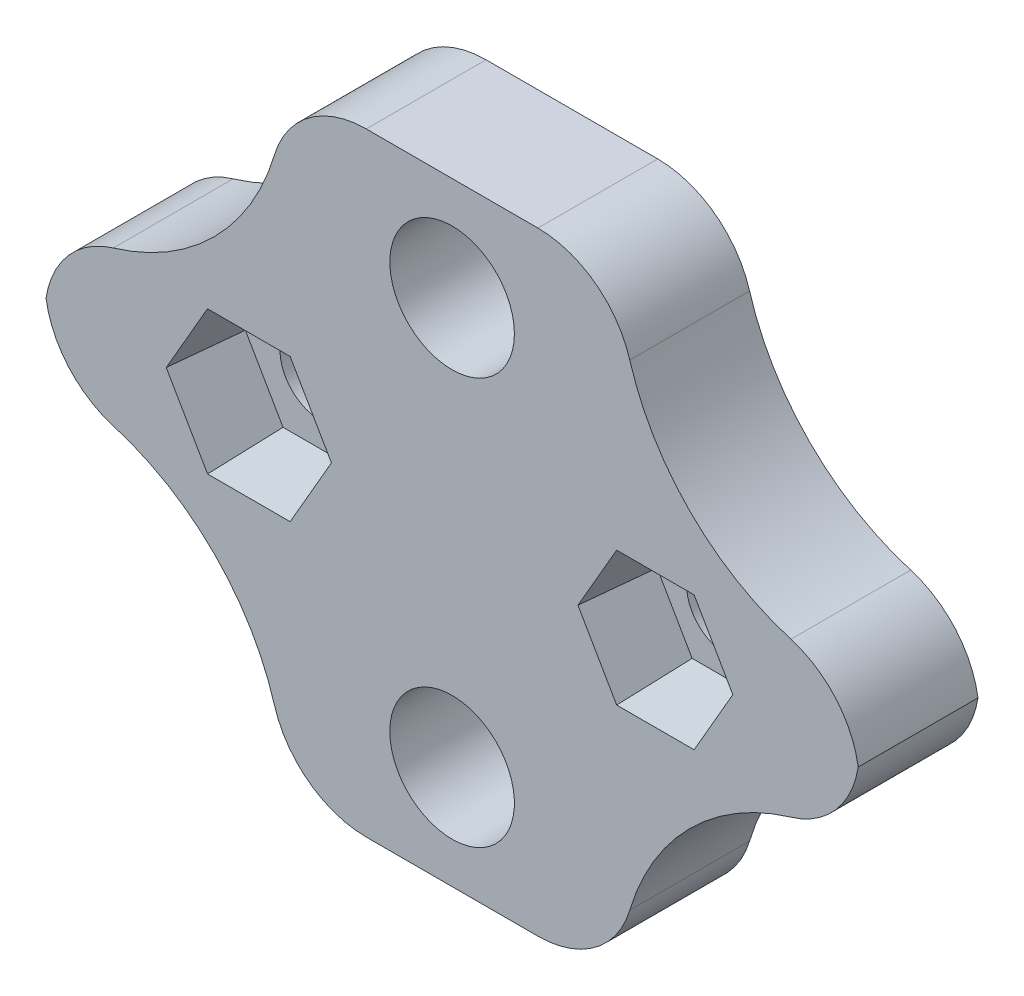
ISO-10303-21;
HEADER;
FILE_DESCRIPTION(('STEP AP214'),'2;1');
FILE_NAME('part.step','',(''),(''),'','','');
FILE_SCHEMA(('AUTOMOTIVE_DESIGN { 1 0 10303 214 1 1 1 1 }'));
ENDSEC;
DATA;
#1=APPLICATION_CONTEXT('core data for automotive mechanical design processes');
#2=APPLICATION_PROTOCOL_DEFINITION('international standard','automotive_design',2000,#1);
#3=PRODUCT_CONTEXT('',#1,'mechanical');
#4=PRODUCT('Part','Part','',(#3));
#5=PRODUCT_RELATED_PRODUCT_CATEGORY('part','',(#4));
#6=PRODUCT_DEFINITION_FORMATION('','',#4);
#7=PRODUCT_DEFINITION_CONTEXT('part definition',#1,'design');
#8=PRODUCT_DEFINITION('design','',#6,#7);
#9=PRODUCT_DEFINITION_SHAPE('','',#8);
#10=(LENGTH_UNIT() NAMED_UNIT(*) SI_UNIT(.MILLI.,.METRE.));
#11=(NAMED_UNIT(*) PLANE_ANGLE_UNIT() SI_UNIT($,.RADIAN.));
#12=(NAMED_UNIT(*) SI_UNIT($,.STERADIAN.) SOLID_ANGLE_UNIT());
#13=UNCERTAINTY_MEASURE_WITH_UNIT(LENGTH_MEASURE(1.E-05),#10,'distance_accuracy_value','');
#14=(GEOMETRIC_REPRESENTATION_CONTEXT(3) GLOBAL_UNCERTAINTY_ASSIGNED_CONTEXT((#13)) GLOBAL_UNIT_ASSIGNED_CONTEXT((#10,
#11,#12)) REPRESENTATION_CONTEXT('',''));
#15=CARTESIAN_POINT('',(0.,0.,0.));
#16=DIRECTION('',(0.,0.,1.));
#17=DIRECTION('',(1.,0.,0.));
#18=AXIS2_PLACEMENT_3D('',#15,#16,#17);
#19=CARTESIAN_POINT('',(5.243837776882,0.,5.));
#20=DIRECTION('',(0.,0.,-1.));
#21=DIRECTION('',(-1.,0.,0.));
#22=AXIS2_PLACEMENT_3D('',#19,#20,#21);
#23=CYLINDRICAL_SURFACE('',#22,1.7);
#24=CARTESIAN_POINT('',(5.243837776882,0.,0.));
#25=DIRECTION('',(0.,0.,1.));
#26=DIRECTION('',(-1.,0.,0.));
#27=AXIS2_PLACEMENT_3D('',#24,#25,#26);
#28=CIRCLE('',#27,1.7);
#29=CARTESIAN_POINT('',(3.543837776882,0.,0.));
#30=VERTEX_POINT('',#29);
#31=EDGE_CURVE('E412',#30,#30,#28,.T.);
#32=ORIENTED_EDGE('',*,*,#31,.F.);
#33=EDGE_LOOP('',(#32));
#34=FACE_BOUND('',#33,.T.);
#35=CARTESIAN_POINT('',(5.243837776882,0.,2.));
#36=DIRECTION('',(0.,0.,1.));
#37=DIRECTION('',(1.,0.,0.));
#38=AXIS2_PLACEMENT_3D('',#35,#36,#37);
#39=CIRCLE('',#38,1.7);
#40=CARTESIAN_POINT('',(6.943837776882,0.,2.));
#41=VERTEX_POINT('',#40);
#42=EDGE_CURVE('E314',#41,#41,#39,.T.);
#43=ORIENTED_EDGE('',*,*,#42,.T.);
#44=EDGE_LOOP('',(#43));
#45=FACE_BOUND('',#44,.T.);
#46=ADVANCED_FACE('F39',(#34,#45),#23,.F.);
#47=CARTESIAN_POINT('',(-11.7267249715951,0.,5.));
#48=DIRECTION('',(0.,0.,-1.));
#49=DIRECTION('',(-1.,0.,0.));
#50=AXIS2_PLACEMENT_3D('',#47,#48,#49);
#51=CYLINDRICAL_SURFACE('',#50,1.7);
#52=CARTESIAN_POINT('',(-11.7267249715951,0.,0.));
#53=DIRECTION('',(0.,0.,1.));
#54=DIRECTION('',(1.,0.,0.));
#55=AXIS2_PLACEMENT_3D('',#52,#53,#54);
#56=CIRCLE('',#55,1.7);
#57=CARTESIAN_POINT('',(-10.0267249715951,0.,0.));
#58=VERTEX_POINT('',#57);
#59=EDGE_CURVE('E429',#58,#58,#56,.T.);
#60=ORIENTED_EDGE('',*,*,#59,.F.);
#61=EDGE_LOOP('',(#60));
#62=FACE_BOUND('',#61,.T.);
#63=CARTESIAN_POINT('',(-11.7267249715951,0.,2.));
#64=DIRECTION('',(0.,0.,1.));
#65=DIRECTION('',(1.,0.,0.));
#66=AXIS2_PLACEMENT_3D('',#63,#64,#65);
#67=CIRCLE('',#66,1.7);
#68=CARTESIAN_POINT('',(-10.0267249715951,0.,2.));
#69=VERTEX_POINT('',#68);
#70=EDGE_CURVE('E372',#69,#69,#67,.T.);
#71=ORIENTED_EDGE('',*,*,#70,.T.);
#72=EDGE_LOOP('',(#71));
#73=FACE_BOUND('',#72,.T.);
#74=ADVANCED_FACE('F612',(#62,#73),#51,.F.);
#75=CARTESIAN_POINT('',(0.,0.,5.));
#76=DIRECTION('',(0.,0.,-1.));
#77=DIRECTION('',(-1.,0.,0.));
#78=AXIS2_PLACEMENT_3D('',#75,#76,#77);
#79=PLANE('',#78);
#80=DIRECTION('',(-0.5,0.866025403784439,0.));
#81=VECTOR('',#80,1.);
#82=CARTESIAN_POINT('',(8.47699928434391,0.,5.));
#83=LINE('',#82,#81);
#84=CARTESIAN_POINT('',(8.47699928434391,0.,5.));
#85=VERTEX_POINT('',#84);
#86=CARTESIAN_POINT('',(6.86041853061296,2.8,5.));
#87=VERTEX_POINT('',#86);
#88=EDGE_CURVE('E282',#85,#87,#83,.T.);
#89=ORIENTED_EDGE('',*,*,#88,.F.);
#90=DIRECTION('',(0.5,0.866025403784439,0.));
#91=VECTOR('',#90,1.);
#92=CARTESIAN_POINT('',(6.86041853061296,-2.8,5.));
#93=LINE('',#92,#91);
#94=CARTESIAN_POINT('',(6.86041853061296,-2.8,5.));
#95=VERTEX_POINT('',#94);
#96=EDGE_CURVE('E287',#95,#85,#93,.T.);
#97=ORIENTED_EDGE('',*,*,#96,.F.);
#98=DIRECTION('',(1.,0.,0.));
#99=VECTOR('',#98,1.);
#100=CARTESIAN_POINT('',(3.62725702315105,-2.8,5.));
#101=LINE('',#100,#99);
#102=CARTESIAN_POINT('',(3.62725702315105,-2.8,5.));
#103=VERTEX_POINT('',#102);
#104=EDGE_CURVE('E306',#103,#95,#101,.T.);
#105=ORIENTED_EDGE('',*,*,#104,.F.);
#106=DIRECTION('',(0.5,-0.866025403784438,0.));
#107=VECTOR('',#106,1.);
#108=CARTESIAN_POINT('',(2.0106762694201,0.,5.));
#109=LINE('',#108,#107);
#110=CARTESIAN_POINT('',(2.0106762694201,0.,5.));
#111=VERTEX_POINT('',#110);
#112=EDGE_CURVE('E299',#111,#103,#109,.T.);
#113=ORIENTED_EDGE('',*,*,#112,.F.);
#114=DIRECTION('',(-0.5,-0.866025403784439,0.));
#115=VECTOR('',#114,1.);
#116=CARTESIAN_POINT('',(3.62725702315105,2.8,5.));
#117=LINE('',#116,#115);
#118=CARTESIAN_POINT('',(3.62725702315105,2.8,5.));
#119=VERTEX_POINT('',#118);
#120=EDGE_CURVE('E293',#119,#111,#117,.T.);
#121=ORIENTED_EDGE('',*,*,#120,.F.);
#122=DIRECTION('',(-1.,0.,0.));
#123=VECTOR('',#122,1.);
#124=CARTESIAN_POINT('',(6.86041853061296,2.8,5.));
#125=LINE('',#124,#123);
#126=EDGE_CURVE('E269',#87,#119,#125,.T.);
#127=ORIENTED_EDGE('',*,*,#126,.F.);
#128=EDGE_LOOP('',(#89,#97,#105,#113,#121,#127));
#129=FACE_BOUND('',#128,.T.);
#130=DIRECTION('',(-0.500000000000001,0.866025403784438,0.));
#131=VECTOR('',#130,1.);
#132=CARTESIAN_POINT('',(-8.27845110569569,0.,5.));
#133=LINE('',#132,#131);
#134=CARTESIAN_POINT('',(-8.27845110569569,0.,5.));
#135=VERTEX_POINT('',#134);
#136=CARTESIAN_POINT('',(-10.0025880386454,2.98629276707487,5.));
#137=VERTEX_POINT('',#136);
#138=EDGE_CURVE('E348',#135,#137,#133,.T.);
#139=ORIENTED_EDGE('',*,*,#138,.F.);
#140=DIRECTION('',(0.499999999999995,0.866025403784441,0.));
#141=VECTOR('',#140,1.);
#142=CARTESIAN_POINT('',(-10.0025880386454,-2.98629276707484,5.));
#143=LINE('',#142,#141);
#144=CARTESIAN_POINT('',(-10.0025880386454,-2.98629276707484,5.));
#145=VERTEX_POINT('',#144);
#146=EDGE_CURVE('E345',#145,#135,#143,.T.);
#147=ORIENTED_EDGE('',*,*,#146,.F.);
#148=DIRECTION('',(1.,0.,0.));
#149=VECTOR('',#148,1.);
#150=CARTESIAN_POINT('',(-13.4508619045448,-2.98629276707488,5.));
#151=LINE('',#150,#149);
#152=CARTESIAN_POINT('',(-13.4508619045448,-2.98629276707488,5.));
#153=VERTEX_POINT('',#152);
#154=EDGE_CURVE('E364',#153,#145,#151,.T.);
#155=ORIENTED_EDGE('',*,*,#154,.F.);
#156=DIRECTION('',(0.500000000000007,-0.866025403784434,0.));
#157=VECTOR('',#156,1.);
#158=CARTESIAN_POINT('',(-15.1749988374945,0.,5.));
#159=LINE('',#158,#157);
#160=CARTESIAN_POINT('',(-15.1749988374945,0.,5.));
#161=VERTEX_POINT('',#160);
#162=EDGE_CURVE('E360',#161,#153,#159,.T.);
#163=ORIENTED_EDGE('',*,*,#162,.F.);
#164=DIRECTION('',(-0.499999999999995,-0.866025403784442,0.));
#165=VECTOR('',#164,1.);
#166=CARTESIAN_POINT('',(-13.4508619045448,2.98629276707486,5.));
#167=LINE('',#166,#165);
#168=CARTESIAN_POINT('',(-13.4508619045448,2.98629276707486,5.));
#169=VERTEX_POINT('',#168);
#170=EDGE_CURVE('E356',#169,#161,#167,.T.);
#171=ORIENTED_EDGE('',*,*,#170,.F.);
#172=DIRECTION('',(-1.,0.,0.));
#173=VECTOR('',#172,1.);
#174=CARTESIAN_POINT('',(-10.0025880386454,2.98629276707487,5.));
#175=LINE('',#174,#173);
#176=EDGE_CURVE('E352',#137,#169,#175,.T.);
#177=ORIENTED_EDGE('',*,*,#176,.F.);
#178=EDGE_LOOP('',(#139,#147,#155,#163,#171,#177));
#179=FACE_BOUND('',#178,.T.);
#180=CARTESIAN_POINT('',(-3.24144359735655,-8.48528137423859,5.));
#181=DIRECTION('',(0.,0.,1.));
#182=DIRECTION('',(-1.,0.,0.));
#183=AXIS2_PLACEMENT_3D('',#180,#181,#182);
#184=CIRCLE('',#183,2.6);
#185=CARTESIAN_POINT('',(-5.84144359735655,-8.48528137423859,5.));
#186=VERTEX_POINT('',#185);
#187=EDGE_CURVE('E417',#186,#186,#184,.T.);
#188=ORIENTED_EDGE('',*,*,#187,.F.);
#189=EDGE_LOOP('',(#188));
#190=FACE_BOUND('',#189,.T.);
#191=DIRECTION('',(1.,0.,0.));
#192=VECTOR('',#191,1.);
#193=CARTESIAN_POINT('',(-20.2414435973565,-12.8,5.));
#194=LINE('',#193,#192);
#195=CARTESIAN_POINT('',(-6.82503573235783,-12.8,5.));
#196=VERTEX_POINT('',#195);
#197=CARTESIAN_POINT('',(0.342148537644728,-12.8,5.));
#198=VERTEX_POINT('',#197);
#199=EDGE_CURVE('E441',#196,#198,#194,.T.);
#200=ORIENTED_EDGE('',*,*,#199,.T.);
#201=CARTESIAN_POINT('',(0.342148537644726,-8.8,5.));
#202=DIRECTION('',(0.,0.,-1.));
#203=DIRECTION('',(-1.,0.,0.));
#204=AXIS2_PLACEMENT_3D('',#201,#202,#203);
#205=CIRCLE('',#204,4.);
#206=CARTESIAN_POINT('',(4.17540792764437,-9.94285714285714,5.));
#207=VERTEX_POINT('',#206);
#208=EDGE_CURVE('E486',#198,#207,#205,.F.);
#209=ORIENTED_EDGE('',*,*,#208,.T.);
#210=CARTESIAN_POINT('',(13.7585564026435,-12.8,5.));
#211=DIRECTION('',(0.,0.,-1.));
#212=DIRECTION('',(-1.,0.,0.));
#213=AXIS2_PLACEMENT_3D('',#210,#211,#212);
#214=CIRCLE('',#213,10.);
#215=CARTESIAN_POINT('',(10.9014135455006,-3.2168515250009,5.));
#216=VERTEX_POINT('',#215);
#217=EDGE_CURVE('E944',#207,#216,#214,.T.);
#218=ORIENTED_EDGE('',*,*,#217,.T.);
#219=CARTESIAN_POINT('',(9.75855640264345,0.616407864998737,5.));
#220=DIRECTION('',(0.,0.,-1.));
#221=DIRECTION('',(-1.,0.,0.));
#222=AXIS2_PLACEMENT_3D('',#219,#220,#221);
#223=CIRCLE('',#222,4.);
#224=CARTESIAN_POINT('',(13.7107762021951,0.,5.));
#225=VERTEX_POINT('',#224);
#226=EDGE_CURVE('E483',#216,#225,#223,.F.);
#227=ORIENTED_EDGE('',*,*,#226,.T.);
#228=CARTESIAN_POINT('',(9.75855640264345,-0.616407864998737,5.));
#229=DIRECTION('',(0.,0.,-1.));
#230=DIRECTION('',(-1.,0.,0.));
#231=AXIS2_PLACEMENT_3D('',#228,#229,#230);
#232=CIRCLE('',#231,4.);
#233=CARTESIAN_POINT('',(10.9014135455006,3.2168515250009,5.));
#234=VERTEX_POINT('',#233);
#235=EDGE_CURVE('E481',#225,#234,#232,.F.);
#236=ORIENTED_EDGE('',*,*,#235,.T.);
#237=CARTESIAN_POINT('',(13.7585564026435,12.8,5.));
#238=DIRECTION('',(0.,0.,-1.));
#239=DIRECTION('',(-1.,0.,0.));
#240=AXIS2_PLACEMENT_3D('',#237,#238,#239);
#241=CIRCLE('',#240,10.);
#242=CARTESIAN_POINT('',(4.17540792764435,9.94285714285714,5.));
#243=VERTEX_POINT('',#242);
#244=EDGE_CURVE('E548',#234,#243,#241,.T.);
#245=ORIENTED_EDGE('',*,*,#244,.T.);
#246=CARTESIAN_POINT('',(0.342148537644712,8.8,5.));
#247=DIRECTION('',(0.,0.,-1.));
#248=DIRECTION('',(-1.,0.,0.));
#249=AXIS2_PLACEMENT_3D('',#246,#247,#248);
#250=CIRCLE('',#249,4.);
#251=CARTESIAN_POINT('',(0.342148537644714,12.8,5.));
#252=VERTEX_POINT('',#251);
#253=EDGE_CURVE('E478',#243,#252,#250,.F.);
#254=ORIENTED_EDGE('',*,*,#253,.T.);
#255=DIRECTION('',(-1.,0.,0.));
#256=VECTOR('',#255,1.);
#257=CARTESIAN_POINT('',(-20.2414435973566,12.8,5.));
#258=LINE('',#257,#256);
#259=CARTESIAN_POINT('',(-6.82503573235781,12.8,5.));
#260=VERTEX_POINT('',#259);
#261=EDGE_CURVE('E437',#252,#260,#258,.T.);
#262=ORIENTED_EDGE('',*,*,#261,.T.);
#263=CARTESIAN_POINT('',(-6.82503573235781,8.8,5.));
#264=DIRECTION('',(0.,0.,-1.));
#265=DIRECTION('',(-1.,0.,0.));
#266=AXIS2_PLACEMENT_3D('',#263,#264,#265);
#267=CIRCLE('',#266,4.);
#268=CARTESIAN_POINT('',(-10.6582951223575,9.94285714285714,5.));
#269=VERTEX_POINT('',#268);
#270=EDGE_CURVE('E466',#260,#269,#267,.F.);
#271=ORIENTED_EDGE('',*,*,#270,.T.);
#272=CARTESIAN_POINT('',(-20.2414435973566,12.8,5.));
#273=DIRECTION('',(0.,0.,-1.));
#274=DIRECTION('',(-1.,0.,0.));
#275=AXIS2_PLACEMENT_3D('',#272,#273,#274);
#276=CIRCLE('',#275,10.);
#277=CARTESIAN_POINT('',(-17.3843007402137,3.2168515250009,5.));
#278=VERTEX_POINT('',#277);
#279=EDGE_CURVE('E573',#269,#278,#276,.T.);
#280=ORIENTED_EDGE('',*,*,#279,.T.);
#281=CARTESIAN_POINT('',(-16.2414435973565,-0.616407864998735,5.));
#282=DIRECTION('',(0.,0.,-1.));
#283=DIRECTION('',(-1.,0.,0.));
#284=AXIS2_PLACEMENT_3D('',#281,#282,#283);
#285=CIRCLE('',#284,4.);
#286=CARTESIAN_POINT('',(-20.1936633969081,0.,5.));
#287=VERTEX_POINT('',#286);
#288=EDGE_CURVE('E469',#278,#287,#285,.F.);
#289=ORIENTED_EDGE('',*,*,#288,.T.);
#290=CARTESIAN_POINT('',(-16.2414435973565,0.616407864998735,5.));
#291=DIRECTION('',(0.,0.,-1.));
#292=DIRECTION('',(-1.,0.,0.));
#293=AXIS2_PLACEMENT_3D('',#290,#291,#292);
#294=CIRCLE('',#293,4.);
#295=CARTESIAN_POINT('',(-17.3843007402137,-3.2168515250009,5.));
#296=VERTEX_POINT('',#295);
#297=EDGE_CURVE('E472',#287,#296,#294,.F.);
#298=ORIENTED_EDGE('',*,*,#297,.T.);
#299=CARTESIAN_POINT('',(-20.2414435973566,-12.8,5.));
#300=DIRECTION('',(0.,0.,-1.));
#301=DIRECTION('',(-1.,0.,0.));
#302=AXIS2_PLACEMENT_3D('',#299,#300,#301);
#303=CIRCLE('',#302,10.);
#304=CARTESIAN_POINT('',(-10.6582951223575,-9.94285714285714,5.));
#305=VERTEX_POINT('',#304);
#306=EDGE_CURVE('E574',#296,#305,#303,.T.);
#307=ORIENTED_EDGE('',*,*,#306,.T.);
#308=CARTESIAN_POINT('',(-6.82503573235783,-8.8,5.));
#309=DIRECTION('',(0.,0.,-1.));
#310=DIRECTION('',(-1.,0.,0.));
#311=AXIS2_PLACEMENT_3D('',#308,#309,#310);
#312=CIRCLE('',#311,4.);
#313=EDGE_CURVE('E475',#305,#196,#312,.F.);
#314=ORIENTED_EDGE('',*,*,#313,.T.);
#315=EDGE_LOOP('',(#200,#209,#218,#227,#236,#245,#254,#262,#271,#280,#289,#298,#307,#314));
#316=FACE_BOUND('',#315,.T.);
#317=CARTESIAN_POINT('',(-3.24144359735655,8.48528137423859,5.));
#318=DIRECTION('',(0.,0.,1.));
#319=DIRECTION('',(1.,0.,0.));
#320=AXIS2_PLACEMENT_3D('',#317,#318,#319);
#321=CIRCLE('',#320,2.6);
#322=CARTESIAN_POINT('',(-0.64144359735655,8.48528137423859,5.));
#323=VERTEX_POINT('',#322);
#324=EDGE_CURVE('E425',#323,#323,#321,.T.);
#325=ORIENTED_EDGE('',*,*,#324,.F.);
#326=EDGE_LOOP('',(#325));
#327=FACE_BOUND('',#326,.T.);
#328=ADVANCED_FACE('F289',(#129,#179,#190,#316,#327),#79,.F.);
#329=CARTESIAN_POINT('',(0.,0.,0.));
#330=DIRECTION('',(0.,0.,-1.));
#331=DIRECTION('',(-1.,0.,0.));
#332=AXIS2_PLACEMENT_3D('',#329,#330,#331);
#333=PLANE('',#332);
#334=CARTESIAN_POINT('',(13.7585564026435,-12.8,0.));
#335=DIRECTION('',(0.,0.,-1.));
#336=DIRECTION('',(-1.,0.,0.));
#337=AXIS2_PLACEMENT_3D('',#334,#335,#336);
#338=CIRCLE('',#337,10.);
#339=CARTESIAN_POINT('',(4.17540792764437,-9.94285714285714,0.));
#340=VERTEX_POINT('',#339);
#341=CARTESIAN_POINT('',(10.9014135455006,-3.2168515250009,0.));
#342=VERTEX_POINT('',#341);
#343=EDGE_CURVE('E946',#340,#342,#338,.T.);
#344=ORIENTED_EDGE('',*,*,#343,.F.);
#345=CARTESIAN_POINT('',(0.342148537644726,-8.8,0.));
#346=DIRECTION('',(0.,0.,-1.));
#347=DIRECTION('',(-1.,0.,0.));
#348=AXIS2_PLACEMENT_3D('',#345,#346,#347);
#349=CIRCLE('',#348,4.);
#350=CARTESIAN_POINT('',(0.342148537644728,-12.8,0.));
#351=VERTEX_POINT('',#350);
#352=EDGE_CURVE('E515',#340,#351,#349,.T.);
#353=ORIENTED_EDGE('',*,*,#352,.T.);
#354=DIRECTION('',(1.,0.,0.));
#355=VECTOR('',#354,1.);
#356=CARTESIAN_POINT('',(-20.2414435973565,-12.8,0.));
#357=LINE('',#356,#355);
#358=CARTESIAN_POINT('',(-6.82503573235783,-12.8,0.));
#359=VERTEX_POINT('',#358);
#360=EDGE_CURVE('E442',#359,#351,#357,.T.);
#361=ORIENTED_EDGE('',*,*,#360,.F.);
#362=CARTESIAN_POINT('',(-6.82503573235783,-8.8,0.));
#363=DIRECTION('',(0.,0.,-1.));
#364=DIRECTION('',(-1.,0.,0.));
#365=AXIS2_PLACEMENT_3D('',#362,#363,#364);
#366=CIRCLE('',#365,4.);
#367=CARTESIAN_POINT('',(-10.6582951223575,-9.94285714285714,0.));
#368=VERTEX_POINT('',#367);
#369=EDGE_CURVE('E504',#359,#368,#366,.T.);
#370=ORIENTED_EDGE('',*,*,#369,.T.);
#371=CARTESIAN_POINT('',(-20.2414435973566,-12.8,0.));
#372=DIRECTION('',(0.,0.,-1.));
#373=DIRECTION('',(1.,0.,0.));
#374=AXIS2_PLACEMENT_3D('',#371,#372,#373);
#375=CIRCLE('',#374,10.);
#376=CARTESIAN_POINT('',(-17.3843007402137,-3.2168515250009,0.));
#377=VERTEX_POINT('',#376);
#378=EDGE_CURVE('E580',#377,#368,#375,.T.);
#379=ORIENTED_EDGE('',*,*,#378,.F.);
#380=CARTESIAN_POINT('',(-16.2414435973565,0.616407864998735,0.));
#381=DIRECTION('',(0.,0.,-1.));
#382=DIRECTION('',(-1.,0.,0.));
#383=AXIS2_PLACEMENT_3D('',#380,#381,#382);
#384=CIRCLE('',#383,4.);
#385=CARTESIAN_POINT('',(-20.1936633969081,0.,0.));
#386=VERTEX_POINT('',#385);
#387=EDGE_CURVE('E70',#377,#386,#384,.T.);
#388=ORIENTED_EDGE('',*,*,#387,.T.);
#389=CARTESIAN_POINT('',(-16.2414435973565,-0.616407864998735,0.));
#390=DIRECTION('',(0.,0.,-1.));
#391=DIRECTION('',(-1.,0.,0.));
#392=AXIS2_PLACEMENT_3D('',#389,#390,#391);
#393=CIRCLE('',#392,4.);
#394=CARTESIAN_POINT('',(-17.3843007402137,3.2168515250009,0.));
#395=VERTEX_POINT('',#394);
#396=EDGE_CURVE('E499',#386,#395,#393,.T.);
#397=ORIENTED_EDGE('',*,*,#396,.T.);
#398=CARTESIAN_POINT('',(-20.2414435973566,12.8,0.));
#399=DIRECTION('',(0.,0.,-1.));
#400=DIRECTION('',(-1.,0.,0.));
#401=AXIS2_PLACEMENT_3D('',#398,#399,#400);
#402=CIRCLE('',#401,10.);
#403=CARTESIAN_POINT('',(-10.6582951223575,9.94285714285714,0.));
#404=VERTEX_POINT('',#403);
#405=EDGE_CURVE('E566',#404,#395,#402,.T.);
#406=ORIENTED_EDGE('',*,*,#405,.F.);
#407=CARTESIAN_POINT('',(-6.82503573235781,8.8,0.));
#408=DIRECTION('',(0.,0.,-1.));
#409=DIRECTION('',(-1.,0.,0.));
#410=AXIS2_PLACEMENT_3D('',#407,#408,#409);
#411=CIRCLE('',#410,4.);
#412=CARTESIAN_POINT('',(-6.82503573235781,12.8,0.));
#413=VERTEX_POINT('',#412);
#414=EDGE_CURVE('E496',#404,#413,#411,.T.);
#415=ORIENTED_EDGE('',*,*,#414,.T.);
#416=DIRECTION('',(-1.,0.,0.));
#417=VECTOR('',#416,1.);
#418=CARTESIAN_POINT('',(-20.2414435973566,12.8,0.));
#419=LINE('',#418,#417);
#420=CARTESIAN_POINT('',(0.342148537644714,12.8,0.));
#421=VERTEX_POINT('',#420);
#422=EDGE_CURVE('E436',#421,#413,#419,.T.);
#423=ORIENTED_EDGE('',*,*,#422,.F.);
#424=CARTESIAN_POINT('',(0.342148537644712,8.8,0.));
#425=DIRECTION('',(0.,0.,-1.));
#426=DIRECTION('',(-1.,0.,0.));
#427=AXIS2_PLACEMENT_3D('',#424,#425,#426);
#428=CIRCLE('',#427,4.);
#429=CARTESIAN_POINT('',(4.17540792764435,9.94285714285714,0.));
#430=VERTEX_POINT('',#429);
#431=EDGE_CURVE('E507',#421,#430,#428,.T.);
#432=ORIENTED_EDGE('',*,*,#431,.T.);
#433=CARTESIAN_POINT('',(13.7585564026435,12.8,0.));
#434=DIRECTION('',(0.,0.,-1.));
#435=DIRECTION('',(1.,0.,0.));
#436=AXIS2_PLACEMENT_3D('',#433,#434,#435);
#437=CIRCLE('',#436,10.);
#438=CARTESIAN_POINT('',(10.9014135455006,3.2168515250009,0.));
#439=VERTEX_POINT('',#438);
#440=EDGE_CURVE('E543',#439,#430,#437,.T.);
#441=ORIENTED_EDGE('',*,*,#440,.F.);
#442=CARTESIAN_POINT('',(9.75855640264345,-0.616407864998737,0.));
#443=DIRECTION('',(0.,0.,-1.));
#444=DIRECTION('',(-1.,0.,0.));
#445=AXIS2_PLACEMENT_3D('',#442,#443,#444);
#446=CIRCLE('',#445,4.);
#447=CARTESIAN_POINT('',(13.7107762021951,0.,0.));
#448=VERTEX_POINT('',#447);
#449=EDGE_CURVE('E60',#439,#448,#446,.T.);
#450=ORIENTED_EDGE('',*,*,#449,.T.);
#451=CARTESIAN_POINT('',(9.75855640264345,0.616407864998737,0.));
#452=DIRECTION('',(0.,0.,-1.));
#453=DIRECTION('',(-1.,0.,0.));
#454=AXIS2_PLACEMENT_3D('',#451,#452,#453);
#455=CIRCLE('',#454,4.);
#456=EDGE_CURVE('E512',#448,#342,#455,.T.);
#457=ORIENTED_EDGE('',*,*,#456,.T.);
#458=EDGE_LOOP('',(#344,#353,#361,#370,#379,#388,#397,#406,#415,#423,#432,#441,#450,#457));
#459=FACE_BOUND('',#458,.T.);
#460=CARTESIAN_POINT('',(-3.24144359735655,-8.48528137423859,0.));
#461=DIRECTION('',(0.,0.,1.));
#462=DIRECTION('',(-1.,0.,0.));
#463=AXIS2_PLACEMENT_3D('',#460,#461,#462);
#464=CIRCLE('',#463,2.6);
#465=CARTESIAN_POINT('',(-5.84144359735655,-8.48528137423859,0.));
#466=VERTEX_POINT('',#465);
#467=EDGE_CURVE('E416',#466,#466,#464,.T.);
#468=ORIENTED_EDGE('',*,*,#467,.T.);
#469=EDGE_LOOP('',(#468));
#470=FACE_BOUND('',#469,.T.);
#471=ORIENTED_EDGE('',*,*,#59,.T.);
#472=EDGE_LOOP('',(#471));
#473=FACE_BOUND('',#472,.T.);
#474=CARTESIAN_POINT('',(-3.24144359735655,8.48528137423859,0.));
#475=DIRECTION('',(0.,0.,1.));
#476=DIRECTION('',(1.,0.,0.));
#477=AXIS2_PLACEMENT_3D('',#474,#475,#476);
#478=CIRCLE('',#477,2.6);
#479=CARTESIAN_POINT('',(-0.64144359735655,8.48528137423859,0.));
#480=VERTEX_POINT('',#479);
#481=EDGE_CURVE('E421',#480,#480,#478,.T.);
#482=ORIENTED_EDGE('',*,*,#481,.T.);
#483=EDGE_LOOP('',(#482));
#484=FACE_BOUND('',#483,.T.);
#485=ORIENTED_EDGE('',*,*,#31,.T.);
#486=EDGE_LOOP('',(#485));
#487=FACE_BOUND('',#486,.T.);
#488=ADVANCED_FACE('F564',(#459,#470,#473,#484,#487),#333,.T.);
#489=CARTESIAN_POINT('',(-20.2414435973566,12.8,5.));
#490=DIRECTION('',(0.,-1.,0.));
#491=DIRECTION('',(0.,0.,-1.));
#492=AXIS2_PLACEMENT_3D('',#489,#490,#491);
#493=PLANE('',#492);
#494=ORIENTED_EDGE('',*,*,#261,.F.);
#495=DIRECTION('',(0.,0.,-1.));
#496=VECTOR('',#495,1.);
#497=CARTESIAN_POINT('',(0.342148537644714,12.8,5.));
#498=LINE('',#497,#496);
#499=EDGE_CURVE('E527',#252,#421,#498,.T.);
#500=ORIENTED_EDGE('',*,*,#499,.T.);
#501=ORIENTED_EDGE('',*,*,#422,.T.);
#502=DIRECTION('',(0.,0.,-1.));
#503=VECTOR('',#502,1.);
#504=CARTESIAN_POINT('',(-6.82503573235781,12.8,5.));
#505=LINE('',#504,#503);
#506=EDGE_CURVE('E524',#413,#260,#505,.F.);
#507=ORIENTED_EDGE('',*,*,#506,.T.);
#508=EDGE_LOOP('',(#494,#500,#501,#507));
#509=FACE_BOUND('',#508,.T.);
#510=ADVANCED_FACE('F640',(#509),#493,.F.);
#511=CARTESIAN_POINT('',(-20.2414435973565,-12.8,5.));
#512=DIRECTION('',(0.,1.,0.));
#513=DIRECTION('',(0.,0.,1.));
#514=AXIS2_PLACEMENT_3D('',#511,#512,#513);
#515=PLANE('',#514);
#516=ORIENTED_EDGE('',*,*,#360,.T.);
#517=DIRECTION('',(0.,0.,-1.));
#518=VECTOR('',#517,1.);
#519=CARTESIAN_POINT('',(0.342148537644728,-12.8,5.));
#520=LINE('',#519,#518);
#521=EDGE_CURVE('E462',#351,#198,#520,.F.);
#522=ORIENTED_EDGE('',*,*,#521,.T.);
#523=ORIENTED_EDGE('',*,*,#199,.F.);
#524=DIRECTION('',(0.,0.,-1.));
#525=VECTOR('',#524,1.);
#526=CARTESIAN_POINT('',(-6.82503573235783,-12.8,5.));
#527=LINE('',#526,#525);
#528=EDGE_CURVE('E446',#196,#359,#527,.T.);
#529=ORIENTED_EDGE('',*,*,#528,.T.);
#530=EDGE_LOOP('',(#516,#522,#523,#529));
#531=FACE_BOUND('',#530,.T.);
#532=ADVANCED_FACE('F633',(#531),#515,.F.);
#533=CARTESIAN_POINT('',(-3.24144359735655,8.48528137423859,5.));
#534=DIRECTION('',(0.,0.,-1.));
#535=DIRECTION('',(-1.,0.,0.));
#536=AXIS2_PLACEMENT_3D('',#533,#534,#535);
#537=CYLINDRICAL_SURFACE('',#536,2.6);
#538=ORIENTED_EDGE('',*,*,#324,.T.);
#539=EDGE_LOOP('',(#538));
#540=FACE_BOUND('',#539,.T.);
#541=ORIENTED_EDGE('',*,*,#481,.F.);
#542=EDGE_LOOP('',(#541));
#543=FACE_BOUND('',#542,.T.);
#544=ADVANCED_FACE('F630',(#540,#543),#537,.F.);
#545=CARTESIAN_POINT('',(-3.24144359735655,-8.48528137423859,5.));
#546=DIRECTION('',(0.,0.,-1.));
#547=DIRECTION('',(-1.,0.,0.));
#548=AXIS2_PLACEMENT_3D('',#545,#546,#547);
#549=CYLINDRICAL_SURFACE('',#548,2.6);
#550=ORIENTED_EDGE('',*,*,#187,.T.);
#551=EDGE_LOOP('',(#550));
#552=FACE_BOUND('',#551,.T.);
#553=ORIENTED_EDGE('',*,*,#467,.F.);
#554=EDGE_LOOP('',(#553));
#555=FACE_BOUND('',#554,.T.);
#556=ADVANCED_FACE('F626',(#552,#555),#549,.F.);
#557=CARTESIAN_POINT('',(-10.0025880386454,-2.98629276707484,5.));
#558=DIRECTION('',(0.862729915662824,-0.498097349045868,-0.0871557427476584));
#559=DIRECTION('',(0.499999999999995,0.866025403784441,0.));
#560=AXIS2_PLACEMENT_3D('',#557,#558,#559);
#561=PLANE('',#560);
#562=ORIENTED_EDGE('',*,*,#146,.T.);
#563=DIRECTION('',(0.100511613750392,0.,0.994935885120891));
#564=VECTOR('',#563,1.);
#565=CARTESIAN_POINT('',(-8.29586934474816,0.,4.8275818043082));
#566=LINE('',#565,#564);
#567=CARTESIAN_POINT('',(-8.58152072632209,0.,2.));
#568=VERTEX_POINT('',#567);
#569=EDGE_CURVE('E374',#568,#135,#566,.T.);
#570=ORIENTED_EDGE('',*,*,#569,.F.);
#571=DIRECTION('',(0.499999999999995,0.866025403784441,0.));
#572=VECTOR('',#571,1.);
#573=CARTESIAN_POINT('',(-6.43614054474161,3.71590747604878,2.));
#574=LINE('',#573,#572);
#575=CARTESIAN_POINT('',(-10.1541228489586,-2.72382677649707,2.));
#576=VERTEX_POINT('',#575);
#577=EDGE_CURVE('E368',#576,#568,#574,.T.);
#578=ORIENTED_EDGE('',*,*,#577,.F.);
#579=DIRECTION('',(0.0502558068751969,-0.0870456108832087,0.994935885120891));
#580=VECTOR('',#579,1.);
#581=CARTESIAN_POINT('',(-10.0112971581716,-2.97120812956622,4.8275818043082));
#582=LINE('',#581,#580);
#583=EDGE_CURVE('E369',#576,#145,#582,.T.);
#584=ORIENTED_EDGE('',*,*,#583,.T.);
#585=EDGE_LOOP('',(#562,#570,#578,#584));
#586=FACE_BOUND('',#585,.T.);
#587=ADVANCED_FACE('F629',(#586),#561,.F.);
#588=CARTESIAN_POINT('',(-13.4508619045448,-2.98629276707488,5.));
#589=DIRECTION('',(0.,-0.996194698091745,-0.0871557427476584));
#590=DIRECTION('',(0.,0.0871557427476584,-0.996194698091746));
#591=AXIS2_PLACEMENT_3D('',#588,#589,#590);
#592=PLANE('',#591);
#593=ORIENTED_EDGE('',*,*,#154,.T.);
#594=ORIENTED_EDGE('',*,*,#583,.F.);
#595=DIRECTION('',(1.,0.,0.));
#596=VECTOR('',#595,1.);
#597=CARTESIAN_POINT('',(0.,-2.72382677649697,2.));
#598=LINE('',#597,#596);
#599=CARTESIAN_POINT('',(-13.2993270942316,-2.7238267764971,2.));
#600=VERTEX_POINT('',#599);
#601=EDGE_CURVE('E379',#600,#576,#598,.T.);
#602=ORIENTED_EDGE('',*,*,#601,.F.);
#603=DIRECTION('',(-0.0502558068751955,-0.0870456108832098,0.994935885120892));
#604=VECTOR('',#603,1.);
#605=CARTESIAN_POINT('',(-13.4421527850185,-2.97120812956625,4.82758180430819));
#606=LINE('',#605,#604);
#607=EDGE_CURVE('E373',#600,#153,#606,.T.);
#608=ORIENTED_EDGE('',*,*,#607,.T.);
#609=EDGE_LOOP('',(#593,#594,#602,#608));
#610=FACE_BOUND('',#609,.T.);
#611=ADVANCED_FACE('F624',(#610),#592,.F.);
#612=CARTESIAN_POINT('',(-15.1749988374945,0.,5.));
#613=DIRECTION('',(-0.862729915662817,-0.49809734904588,-0.0871557427476584));
#614=DIRECTION('',(0.500000000000007,-0.866025403784434,0.));
#615=AXIS2_PLACEMENT_3D('',#612,#613,#614);
#616=PLANE('',#615);
#617=ORIENTED_EDGE('',*,*,#162,.T.);
#618=ORIENTED_EDGE('',*,*,#607,.F.);
#619=DIRECTION('',(0.500000000000007,-0.866025403784434,0.));
#620=VECTOR('',#619,1.);
#621=CARTESIAN_POINT('',(-11.153946912651,-6.43973425254597,2.));
#622=LINE('',#621,#620);
#623=CARTESIAN_POINT('',(-14.8719292168681,0.,2.));
#624=VERTEX_POINT('',#623);
#625=EDGE_CURVE('E397',#624,#600,#622,.T.);
#626=ORIENTED_EDGE('',*,*,#625,.F.);
#627=DIRECTION('',(-0.100511613750393,0.,0.994935885120892));
#628=VECTOR('',#627,1.);
#629=CARTESIAN_POINT('',(-15.157580598442,0.,4.82758180430819));
#630=LINE('',#629,#628);
#631=EDGE_CURVE('E385',#624,#161,#630,.T.);
#632=ORIENTED_EDGE('',*,*,#631,.T.);
#633=EDGE_LOOP('',(#617,#618,#626,#632));
#634=FACE_BOUND('',#633,.T.);
#635=ADVANCED_FACE('F826',(#634),#616,.F.);
#636=CARTESIAN_POINT('',(-13.4508619045448,2.98629276707486,5.));
#637=DIRECTION('',(-0.862729915662824,0.498097349045868,-0.0871557427476584));
#638=DIRECTION('',(-0.499999999999995,-0.866025403784442,0.));
#639=AXIS2_PLACEMENT_3D('',#636,#637,#638);
#640=PLANE('',#639);
#641=ORIENTED_EDGE('',*,*,#170,.T.);
#642=ORIENTED_EDGE('',*,*,#631,.F.);
#643=DIRECTION('',(-0.499999999999995,-0.866025403784442,0.));
#644=VECTOR('',#643,1.);
#645=CARTESIAN_POINT('',(-11.1539469126512,6.43973425254585,2.));
#646=LINE('',#645,#644);
#647=CARTESIAN_POINT('',(-13.2993270942316,2.72382677649708,2.));
#648=VERTEX_POINT('',#647);
#649=EDGE_CURVE('E401',#648,#624,#646,.T.);
#650=ORIENTED_EDGE('',*,*,#649,.F.);
#651=DIRECTION('',(-0.0502558068751967,0.0870456108832091,0.994935885120892));
#652=VECTOR('',#651,1.);
#653=CARTESIAN_POINT('',(-13.4421527850186,2.97120812956623,4.82758180430819));
#654=LINE('',#653,#652);
#655=EDGE_CURVE('E382',#648,#169,#654,.T.);
#656=ORIENTED_EDGE('',*,*,#655,.T.);
#657=EDGE_LOOP('',(#641,#642,#650,#656));
#658=FACE_BOUND('',#657,.T.);
#659=ADVANCED_FACE('F817',(#658),#640,.F.);
#660=CARTESIAN_POINT('',(-10.0025880386454,2.98629276707487,5.));
#661=DIRECTION('',(0.,0.996194698091745,-0.0871557427476584));
#662=DIRECTION('',(0.,0.0871557427476584,0.996194698091746));
#663=AXIS2_PLACEMENT_3D('',#660,#661,#662);
#664=PLANE('',#663);
#665=ORIENTED_EDGE('',*,*,#176,.T.);
#666=ORIENTED_EDGE('',*,*,#655,.F.);
#667=DIRECTION('',(-1.,0.,0.));
#668=VECTOR('',#667,1.);
#669=CARTESIAN_POINT('',(0.,2.72382677649713,2.));
#670=LINE('',#669,#668);
#671=CARTESIAN_POINT('',(-10.1541228489586,2.72382677649709,2.));
#672=VERTEX_POINT('',#671);
#673=EDGE_CURVE('E405',#672,#648,#670,.T.);
#674=ORIENTED_EDGE('',*,*,#673,.F.);
#675=DIRECTION('',(0.0502558068751961,0.0870456108832094,0.994935885120891));
#676=VECTOR('',#675,1.);
#677=CARTESIAN_POINT('',(-10.0112971581716,2.97120812956624,4.82758180430819));
#678=LINE('',#677,#676);
#679=EDGE_CURVE('E378',#672,#137,#678,.T.);
#680=ORIENTED_EDGE('',*,*,#679,.T.);
#681=EDGE_LOOP('',(#665,#666,#674,#680));
#682=FACE_BOUND('',#681,.T.);
#683=ADVANCED_FACE('F808',(#682),#664,.F.);
#684=CARTESIAN_POINT('',(-8.27845110569569,0.,5.));
#685=DIRECTION('',(0.86272991566282,0.498097349045874,-0.0871557427476584));
#686=DIRECTION('',(-0.500000000000001,0.866025403784438,0.));
#687=AXIS2_PLACEMENT_3D('',#684,#685,#686);
#688=PLANE('',#687);
#689=ORIENTED_EDGE('',*,*,#138,.T.);
#690=ORIENTED_EDGE('',*,*,#679,.F.);
#691=DIRECTION('',(-0.500000000000001,0.866025403784438,0.));
#692=VECTOR('',#691,1.);
#693=CARTESIAN_POINT('',(-6.43614054474156,-3.71590747604881,2.));
#694=LINE('',#693,#692);
#695=EDGE_CURVE('E393',#568,#672,#694,.T.);
#696=ORIENTED_EDGE('',*,*,#695,.F.);
#697=ORIENTED_EDGE('',*,*,#569,.T.);
#698=EDGE_LOOP('',(#689,#690,#696,#697));
#699=FACE_BOUND('',#698,.T.);
#700=ADVANCED_FACE('F799',(#699),#688,.F.);
#701=CARTESIAN_POINT('',(0.,0.,2.));
#702=DIRECTION('',(0.,0.,1.));
#703=DIRECTION('',(1.,0.,0.));
#704=AXIS2_PLACEMENT_3D('',#701,#702,#703);
#705=PLANE('',#704);
#706=ORIENTED_EDGE('',*,*,#70,.F.);
#707=EDGE_LOOP('',(#706));
#708=FACE_BOUND('',#707,.T.);
#709=ORIENTED_EDGE('',*,*,#577,.T.);
#710=ORIENTED_EDGE('',*,*,#695,.T.);
#711=ORIENTED_EDGE('',*,*,#673,.T.);
#712=ORIENTED_EDGE('',*,*,#649,.T.);
#713=ORIENTED_EDGE('',*,*,#625,.T.);
#714=ORIENTED_EDGE('',*,*,#601,.T.);
#715=EDGE_LOOP('',(#709,#710,#711,#712,#713,#714));
#716=FACE_BOUND('',#715,.T.);
#717=ADVANCED_FACE('F792',(#708,#716),#705,.T.);
#718=CARTESIAN_POINT('',(6.86041853061296,-2.8,5.));
#719=DIRECTION('',(0.862729915662821,-0.498097349045873,-0.0871557427476584));
#720=DIRECTION('',(0.5,0.866025403784439,0.));
#721=AXIS2_PLACEMENT_3D('',#718,#719,#720);
#722=PLANE('',#721);
#723=ORIENTED_EDGE('',*,*,#96,.T.);
#724=DIRECTION('',(0.100511613750393,0.,0.994935885120892));
#725=VECTOR('',#724,1.);
#726=CARTESIAN_POINT('',(8.46066764068036,0.,4.83833770310138));
#727=LINE('',#726,#725);
#728=CARTESIAN_POINT('',(8.17392966371751,0.,2.));
#729=VERTEX_POINT('',#728);
#730=EDGE_CURVE('E278',#729,#85,#727,.T.);
#731=ORIENTED_EDGE('',*,*,#730,.F.);
#732=DIRECTION('',(0.5,0.866025403784439,0.));
#733=VECTOR('',#732,1.);
#734=CARTESIAN_POINT('',(6.13044724778814,-3.53941536876328,2.));
#735=LINE('',#734,#733);
#736=CARTESIAN_POINT('',(6.70888372029976,-2.53753400942223,2.));
#737=VERTEX_POINT('',#736);
#738=EDGE_CURVE('E310',#737,#729,#735,.T.);
#739=ORIENTED_EDGE('',*,*,#738,.F.);
#740=DIRECTION('',(0.0502558068751963,-0.0870456108832093,0.994935885120891));
#741=VECTOR('',#740,1.);
#742=CARTESIAN_POINT('',(6.85225270878118,-2.78585638170181,4.83833770310138));
#743=LINE('',#742,#741);
#744=EDGE_CURVE('E311',#737,#95,#743,.T.);
#745=ORIENTED_EDGE('',*,*,#744,.T.);
#746=EDGE_LOOP('',(#723,#731,#739,#745));
#747=FACE_BOUND('',#746,.T.);
#748=ADVANCED_FACE('F585',(#747),#722,.F.);
#749=CARTESIAN_POINT('',(3.62725702315105,-2.8,5.));
#750=DIRECTION('',(0.,-0.996194698091746,-0.0871557427476584));
#751=DIRECTION('',(0.,0.0871557427476584,-0.996194698091746));
#752=AXIS2_PLACEMENT_3D('',#749,#750,#751);
#753=PLANE('',#752);
#754=ORIENTED_EDGE('',*,*,#104,.T.);
#755=ORIENTED_EDGE('',*,*,#744,.F.);
#756=DIRECTION('',(1.,0.,0.));
#757=VECTOR('',#756,1.);
#758=CARTESIAN_POINT('',(0.,-2.53753400942223,2.));
#759=LINE('',#758,#757);
#760=CARTESIAN_POINT('',(3.77879183346425,-2.53753400942223,2.));
#761=VERTEX_POINT('',#760);
#762=EDGE_CURVE('E317',#761,#737,#759,.T.);
#763=ORIENTED_EDGE('',*,*,#762,.F.);
#764=DIRECTION('',(-0.0502558068751962,-0.0870456108832093,0.994935885120892));
#765=VECTOR('',#764,1.);
#766=CARTESIAN_POINT('',(3.63542284498283,-2.78585638170181,4.83833770310138));
#767=LINE('',#766,#765);
#768=EDGE_CURVE('E315',#761,#103,#767,.T.);
#769=ORIENTED_EDGE('',*,*,#768,.T.);
#770=EDGE_LOOP('',(#754,#755,#763,#769));
#771=FACE_BOUND('',#770,.T.);
#772=ADVANCED_FACE('F589',(#771),#753,.F.);
#773=CARTESIAN_POINT('',(2.0106762694201,0.,5.));
#774=DIRECTION('',(-0.862729915662821,-0.498097349045873,-0.0871557427476584));
#775=DIRECTION('',(0.5,-0.866025403784439,0.));
#776=AXIS2_PLACEMENT_3D('',#773,#774,#775);
#777=PLANE('',#776);
#778=ORIENTED_EDGE('',*,*,#112,.T.);
#779=ORIENTED_EDGE('',*,*,#768,.F.);
#780=DIRECTION('',(0.5,-0.866025403784439,0.));
#781=VECTOR('',#780,1.);
#782=CARTESIAN_POINT('',(1.73530941753487,1.00188135934105,2.));
#783=LINE('',#782,#781);
#784=CARTESIAN_POINT('',(2.3137458900465,0.,2.));
#785=VERTEX_POINT('',#784);
#786=EDGE_CURVE('E333',#785,#761,#783,.T.);
#787=ORIENTED_EDGE('',*,*,#786,.F.);
#788=DIRECTION('',(-0.100511613750393,0.,0.994935885120892));
#789=VECTOR('',#788,1.);
#790=CARTESIAN_POINT('',(2.02700791308365,0.,4.83833770310138));
#791=LINE('',#790,#789);
#792=EDGE_CURVE('E321',#785,#111,#791,.T.);
#793=ORIENTED_EDGE('',*,*,#792,.T.);
#794=EDGE_LOOP('',(#778,#779,#787,#793));
#795=FACE_BOUND('',#794,.T.);
#796=ADVANCED_FACE('F593',(#795),#777,.F.);
#797=CARTESIAN_POINT('',(3.62725702315105,2.8,5.));
#798=DIRECTION('',(-0.862729915662821,0.498097349045873,-0.0871557427476584));
#799=DIRECTION('',(-0.5,-0.866025403784439,0.));
#800=AXIS2_PLACEMENT_3D('',#797,#798,#799);
#801=PLANE('',#800);
#802=ORIENTED_EDGE('',*,*,#120,.T.);
#803=ORIENTED_EDGE('',*,*,#792,.F.);
#804=DIRECTION('',(-0.5,-0.866025403784439,0.));
#805=VECTOR('',#804,1.);
#806=CARTESIAN_POINT('',(1.73530941753487,-1.00188135934105,2.));
#807=LINE('',#806,#805);
#808=CARTESIAN_POINT('',(3.77879183346425,2.53753400942223,2.));
#809=VERTEX_POINT('',#808);
#810=EDGE_CURVE('E337',#809,#785,#807,.T.);
#811=ORIENTED_EDGE('',*,*,#810,.F.);
#812=DIRECTION('',(-0.0502558068751963,0.0870456108832092,0.994935885120891));
#813=VECTOR('',#812,1.);
#814=CARTESIAN_POINT('',(3.63542284498283,2.78585638170181,4.83833770310138));
#815=LINE('',#814,#813);
#816=EDGE_CURVE('E277',#809,#119,#815,.T.);
#817=ORIENTED_EDGE('',*,*,#816,.T.);
#818=EDGE_LOOP('',(#802,#803,#811,#817));
#819=FACE_BOUND('',#818,.T.);
#820=ADVANCED_FACE('F596',(#819),#801,.F.);
#821=CARTESIAN_POINT('',(6.86041853061296,2.8,5.));
#822=DIRECTION('',(0.,0.996194698091746,-0.0871557427476584));
#823=DIRECTION('',(0.,0.0871557427476584,0.996194698091746));
#824=AXIS2_PLACEMENT_3D('',#821,#822,#823);
#825=PLANE('',#824);
#826=ORIENTED_EDGE('',*,*,#126,.T.);
#827=ORIENTED_EDGE('',*,*,#816,.F.);
#828=DIRECTION('',(-1.,0.,0.));
#829=VECTOR('',#828,1.);
#830=CARTESIAN_POINT('',(0.,2.53753400942223,2.));
#831=LINE('',#830,#829);
#832=CARTESIAN_POINT('',(6.70888372029976,2.53753400942223,2.));
#833=VERTEX_POINT('',#832);
#834=EDGE_CURVE('E272',#833,#809,#831,.T.);
#835=ORIENTED_EDGE('',*,*,#834,.F.);
#836=DIRECTION('',(0.0502558068751963,0.0870456108832093,0.994935885120892));
#837=VECTOR('',#836,1.);
#838=CARTESIAN_POINT('',(6.85225270878118,2.78585638170181,4.83833770310138));
#839=LINE('',#838,#837);
#840=EDGE_CURVE('E265',#833,#87,#839,.T.);
#841=ORIENTED_EDGE('',*,*,#840,.T.);
#842=EDGE_LOOP('',(#826,#827,#835,#841));
#843=FACE_BOUND('',#842,.T.);
#844=ADVANCED_FACE('F267',(#843),#825,.F.);
#845=CARTESIAN_POINT('',(8.47699928434391,0.,5.));
#846=DIRECTION('',(0.862729915662821,0.498097349045873,-0.0871557427476584));
#847=DIRECTION('',(-0.5,0.866025403784439,0.));
#848=AXIS2_PLACEMENT_3D('',#845,#846,#847);
#849=PLANE('',#848);
#850=ORIENTED_EDGE('',*,*,#88,.T.);
#851=ORIENTED_EDGE('',*,*,#840,.F.);
#852=DIRECTION('',(-0.5,0.866025403784439,0.));
#853=VECTOR('',#852,1.);
#854=CARTESIAN_POINT('',(6.13044724778813,3.53941536876328,2.));
#855=LINE('',#854,#853);
#856=EDGE_CURVE('E329',#729,#833,#855,.T.);
#857=ORIENTED_EDGE('',*,*,#856,.F.);
#858=ORIENTED_EDGE('',*,*,#730,.T.);
#859=EDGE_LOOP('',(#850,#851,#857,#858));
#860=FACE_BOUND('',#859,.T.);
#861=ADVANCED_FACE('F283',(#860),#849,.F.);
#862=CARTESIAN_POINT('',(0.,0.,2.));
#863=DIRECTION('',(0.,0.,1.));
#864=DIRECTION('',(1.,0.,0.));
#865=AXIS2_PLACEMENT_3D('',#862,#863,#864);
#866=PLANE('',#865);
#867=ORIENTED_EDGE('',*,*,#42,.F.);
#868=EDGE_LOOP('',(#867));
#869=FACE_BOUND('',#868,.T.);
#870=ORIENTED_EDGE('',*,*,#738,.T.);
#871=ORIENTED_EDGE('',*,*,#856,.T.);
#872=ORIENTED_EDGE('',*,*,#834,.T.);
#873=ORIENTED_EDGE('',*,*,#810,.T.);
#874=ORIENTED_EDGE('',*,*,#786,.T.);
#875=ORIENTED_EDGE('',*,*,#762,.T.);
#876=EDGE_LOOP('',(#870,#871,#872,#873,#874,#875));
#877=FACE_BOUND('',#876,.T.);
#878=ADVANCED_FACE('F598',(#869,#877),#866,.T.);
#879=CARTESIAN_POINT('',(-20.2414435973566,12.8,10.));
#880=DIRECTION('',(0.,0.,-1.));
#881=DIRECTION('',(-1.,0.,0.));
#882=AXIS2_PLACEMENT_3D('',#879,#880,#881);
#883=CYLINDRICAL_SURFACE('',#882,10.);
#884=ORIENTED_EDGE('',*,*,#405,.T.);
#885=DIRECTION('',(0.,0.,-1.));
#886=VECTOR('',#885,1.);
#887=CARTESIAN_POINT('',(-17.3843007402137,3.2168515250009,10.));
#888=LINE('',#887,#886);
#889=EDGE_CURVE('E11',#395,#278,#888,.F.);
#890=ORIENTED_EDGE('',*,*,#889,.T.);
#891=ORIENTED_EDGE('',*,*,#279,.F.);
#892=DIRECTION('',(0.,0.,-1.));
#893=VECTOR('',#892,1.);
#894=CARTESIAN_POINT('',(-10.6582951223575,9.94285714285714,10.));
#895=LINE('',#894,#893);
#896=EDGE_CURVE('E49',#269,#404,#895,.T.);
#897=ORIENTED_EDGE('',*,*,#896,.T.);
#898=EDGE_LOOP('',(#884,#890,#891,#897));
#899=FACE_BOUND('',#898,.T.);
#900=ADVANCED_FACE('F568',(#899),#883,.F.);
#901=CARTESIAN_POINT('',(-20.2414435973566,-12.8,10.));
#902=DIRECTION('',(0.,0.,-1.));
#903=DIRECTION('',(-1.,0.,0.));
#904=AXIS2_PLACEMENT_3D('',#901,#902,#903);
#905=CYLINDRICAL_SURFACE('',#904,10.);
#906=ORIENTED_EDGE('',*,*,#378,.T.);
#907=DIRECTION('',(0.,0.,-1.));
#908=VECTOR('',#907,1.);
#909=CARTESIAN_POINT('',(-10.6582951223575,-9.94285714285714,10.));
#910=LINE('',#909,#908);
#911=EDGE_CURVE('E535',#368,#305,#910,.F.);
#912=ORIENTED_EDGE('',*,*,#911,.T.);
#913=ORIENTED_EDGE('',*,*,#306,.F.);
#914=DIRECTION('',(0.,0.,-1.));
#915=VECTOR('',#914,1.);
#916=CARTESIAN_POINT('',(-17.3843007402137,-3.2168515250009,10.));
#917=LINE('',#916,#915);
#918=EDGE_CURVE('E531',#296,#377,#917,.T.);
#919=ORIENTED_EDGE('',*,*,#918,.T.);
#920=EDGE_LOOP('',(#906,#912,#913,#919));
#921=FACE_BOUND('',#920,.T.);
#922=ADVANCED_FACE('F606',(#921),#905,.F.);
#923=CARTESIAN_POINT('',(13.7585564026435,-12.8,10.));
#924=DIRECTION('',(0.,0.,-1.));
#925=DIRECTION('',(-1.,0.,0.));
#926=AXIS2_PLACEMENT_3D('',#923,#924,#925);
#927=CYLINDRICAL_SURFACE('',#926,10.);
#928=ORIENTED_EDGE('',*,*,#217,.F.);
#929=DIRECTION('',(0.,0.,-1.));
#930=VECTOR('',#929,1.);
#931=CARTESIAN_POINT('',(4.17540792764437,-9.94285714285714,10.));
#932=LINE('',#931,#930);
#933=EDGE_CURVE('E493',#207,#340,#932,.T.);
#934=ORIENTED_EDGE('',*,*,#933,.T.);
#935=ORIENTED_EDGE('',*,*,#343,.T.);
#936=DIRECTION('',(0.,0.,-1.));
#937=VECTOR('',#936,1.);
#938=CARTESIAN_POINT('',(10.9014135455006,-3.2168515250009,10.));
#939=LINE('',#938,#937);
#940=EDGE_CURVE('E489',#342,#216,#939,.F.);
#941=ORIENTED_EDGE('',*,*,#940,.T.);
#942=EDGE_LOOP('',(#928,#934,#935,#941));
#943=FACE_BOUND('',#942,.T.);
#944=ADVANCED_FACE('F721',(#943),#927,.F.);
#945=CARTESIAN_POINT('',(13.7585564026435,12.8,10.));
#946=DIRECTION('',(0.,0.,-1.));
#947=DIRECTION('',(-1.,0.,0.));
#948=AXIS2_PLACEMENT_3D('',#945,#946,#947);
#949=CYLINDRICAL_SURFACE('',#948,10.);
#950=ORIENTED_EDGE('',*,*,#244,.F.);
#951=DIRECTION('',(0.,0.,-1.));
#952=VECTOR('',#951,1.);
#953=CARTESIAN_POINT('',(10.9014135455006,3.2168515250009,10.));
#954=LINE('',#953,#952);
#955=EDGE_CURVE('E521',#234,#439,#954,.T.);
#956=ORIENTED_EDGE('',*,*,#955,.T.);
#957=ORIENTED_EDGE('',*,*,#440,.T.);
#958=DIRECTION('',(0.,0.,-1.));
#959=VECTOR('',#958,1.);
#960=CARTESIAN_POINT('',(4.17540792764435,9.94285714285714,10.));
#961=LINE('',#960,#959);
#962=EDGE_CURVE('E518',#430,#243,#961,.F.);
#963=ORIENTED_EDGE('',*,*,#962,.T.);
#964=EDGE_LOOP('',(#950,#956,#957,#963));
#965=FACE_BOUND('',#964,.T.);
#966=ADVANCED_FACE('F651',(#965),#949,.F.);
#967=CARTESIAN_POINT('',(0.342148537644726,-8.8,10.));
#968=DIRECTION('',(0.,0.,-1.));
#969=DIRECTION('',(-1.,0.,0.));
#970=AXIS2_PLACEMENT_3D('',#967,#968,#969);
#971=CYLINDRICAL_SURFACE('',#970,4.);
#972=ORIENTED_EDGE('',*,*,#352,.F.);
#973=ORIENTED_EDGE('',*,*,#933,.F.);
#974=ORIENTED_EDGE('',*,*,#208,.F.);
#975=ORIENTED_EDGE('',*,*,#521,.F.);
#976=EDGE_LOOP('',(#972,#973,#974,#975));
#977=FACE_BOUND('',#976,.T.);
#978=ADVANCED_FACE('F647',(#977),#971,.T.);
#979=CARTESIAN_POINT('',(9.75855640264345,-0.616407864998737,10.));
#980=DIRECTION('',(0.,0.,-1.));
#981=DIRECTION('',(-1.,0.,0.));
#982=AXIS2_PLACEMENT_3D('',#979,#980,#981);
#983=CYLINDRICAL_SURFACE('',#982,4.);
#984=ORIENTED_EDGE('',*,*,#955,.F.);
#985=ORIENTED_EDGE('',*,*,#235,.F.);
#986=DIRECTION('',(0.,0.,-1.));
#987=VECTOR('',#986,1.);
#988=CARTESIAN_POINT('',(13.7107762021951,0.,2.5));
#989=LINE('',#988,#987);
#990=EDGE_CURVE('E540',#448,#225,#989,.F.);
#991=ORIENTED_EDGE('',*,*,#990,.F.);
#992=ORIENTED_EDGE('',*,*,#449,.F.);
#993=EDGE_LOOP('',(#984,#985,#991,#992));
#994=FACE_BOUND('',#993,.T.);
#995=ADVANCED_FACE('F650',(#994),#983,.T.);
#996=CARTESIAN_POINT('',(9.75855640264345,0.616407864998737,10.));
#997=DIRECTION('',(0.,0.,-1.));
#998=DIRECTION('',(-1.,0.,0.));
#999=AXIS2_PLACEMENT_3D('',#996,#997,#998);
#1000=CYLINDRICAL_SURFACE('',#999,4.);
#1001=ORIENTED_EDGE('',*,*,#226,.F.);
#1002=ORIENTED_EDGE('',*,*,#940,.F.);
#1003=ORIENTED_EDGE('',*,*,#456,.F.);
#1004=ORIENTED_EDGE('',*,*,#990,.T.);
#1005=EDGE_LOOP('',(#1001,#1002,#1003,#1004));
#1006=FACE_BOUND('',#1005,.T.);
#1007=ADVANCED_FACE('F653',(#1006),#1000,.T.);
#1008=CARTESIAN_POINT('',(0.342148537644712,8.8,10.));
#1009=DIRECTION('',(0.,0.,-1.));
#1010=DIRECTION('',(-1.,0.,0.));
#1011=AXIS2_PLACEMENT_3D('',#1008,#1009,#1010);
#1012=CYLINDRICAL_SURFACE('',#1011,4.);
#1013=ORIENTED_EDGE('',*,*,#253,.F.);
#1014=ORIENTED_EDGE('',*,*,#962,.F.);
#1015=ORIENTED_EDGE('',*,*,#431,.F.);
#1016=ORIENTED_EDGE('',*,*,#499,.F.);
#1017=EDGE_LOOP('',(#1013,#1014,#1015,#1016));
#1018=FACE_BOUND('',#1017,.T.);
#1019=ADVANCED_FACE('F656',(#1018),#1012,.T.);
#1020=CARTESIAN_POINT('',(-6.82503573235783,-8.8,10.));
#1021=DIRECTION('',(0.,0.,-1.));
#1022=DIRECTION('',(-1.,0.,0.));
#1023=AXIS2_PLACEMENT_3D('',#1020,#1021,#1022);
#1024=CYLINDRICAL_SURFACE('',#1023,4.);
#1025=ORIENTED_EDGE('',*,*,#313,.F.);
#1026=ORIENTED_EDGE('',*,*,#911,.F.);
#1027=ORIENTED_EDGE('',*,*,#369,.F.);
#1028=ORIENTED_EDGE('',*,*,#528,.F.);
#1029=EDGE_LOOP('',(#1025,#1026,#1027,#1028));
#1030=FACE_BOUND('',#1029,.T.);
#1031=ADVANCED_FACE('F662',(#1030),#1024,.T.);
#1032=CARTESIAN_POINT('',(-16.2414435973565,-0.616407864998735,10.));
#1033=DIRECTION('',(0.,0.,-1.));
#1034=DIRECTION('',(-1.,0.,0.));
#1035=AXIS2_PLACEMENT_3D('',#1032,#1033,#1034);
#1036=CYLINDRICAL_SURFACE('',#1035,4.);
#1037=DIRECTION('',(0.,0.,-1.));
#1038=VECTOR('',#1037,1.);
#1039=CARTESIAN_POINT('',(-20.1936633969081,0.,2.5));
#1040=LINE('',#1039,#1038);
#1041=EDGE_CURVE('E43',#287,#386,#1040,.T.);
#1042=ORIENTED_EDGE('',*,*,#1041,.F.);
#1043=ORIENTED_EDGE('',*,*,#288,.F.);
#1044=ORIENTED_EDGE('',*,*,#889,.F.);
#1045=ORIENTED_EDGE('',*,*,#396,.F.);
#1046=EDGE_LOOP('',(#1042,#1043,#1044,#1045));
#1047=FACE_BOUND('',#1046,.T.);
#1048=ADVANCED_FACE('F559',(#1047),#1036,.T.);
#1049=CARTESIAN_POINT('',(-16.2414435973565,0.616407864998735,10.));
#1050=DIRECTION('',(0.,0.,-1.));
#1051=DIRECTION('',(-1.,0.,0.));
#1052=AXIS2_PLACEMENT_3D('',#1049,#1050,#1051);
#1053=CYLINDRICAL_SURFACE('',#1052,4.);
#1054=ORIENTED_EDGE('',*,*,#297,.F.);
#1055=ORIENTED_EDGE('',*,*,#1041,.T.);
#1056=ORIENTED_EDGE('',*,*,#387,.F.);
#1057=ORIENTED_EDGE('',*,*,#918,.F.);
#1058=EDGE_LOOP('',(#1054,#1055,#1056,#1057));
#1059=FACE_BOUND('',#1058,.T.);
#1060=ADVANCED_FACE('F555',(#1059),#1053,.T.);
#1061=CARTESIAN_POINT('',(-6.82503573235781,8.8,10.));
#1062=DIRECTION('',(0.,0.,-1.));
#1063=DIRECTION('',(-1.,0.,0.));
#1064=AXIS2_PLACEMENT_3D('',#1061,#1062,#1063);
#1065=CYLINDRICAL_SURFACE('',#1064,4.);
#1066=ORIENTED_EDGE('',*,*,#270,.F.);
#1067=ORIENTED_EDGE('',*,*,#506,.F.);
#1068=ORIENTED_EDGE('',*,*,#414,.F.);
#1069=ORIENTED_EDGE('',*,*,#896,.F.);
#1070=EDGE_LOOP('',(#1066,#1067,#1068,#1069));
#1071=FACE_BOUND('',#1070,.T.);
#1072=ADVANCED_FACE('F41',(#1071),#1065,.T.);
#1073=CLOSED_SHELL('',(#46,#74,#328,#488,#510,#532,#544,#556,#587,#611,#635,#659,#683,#700,#717,
#748,#772,#796,#820,#844,#861,#878,#900,#922,#944,#966,#978,#995,#1007,#1019,#1031,#1048,#1060,#1072));
#1074=MANIFOLD_SOLID_BREP('B2',#1073);
#1075=ADVANCED_BREP_SHAPE_REPRESENTATION('',(#18,#1074),#14);
#1076=SHAPE_DEFINITION_REPRESENTATION(#9,#1075);
ENDSEC;
END-ISO-10303-21;
